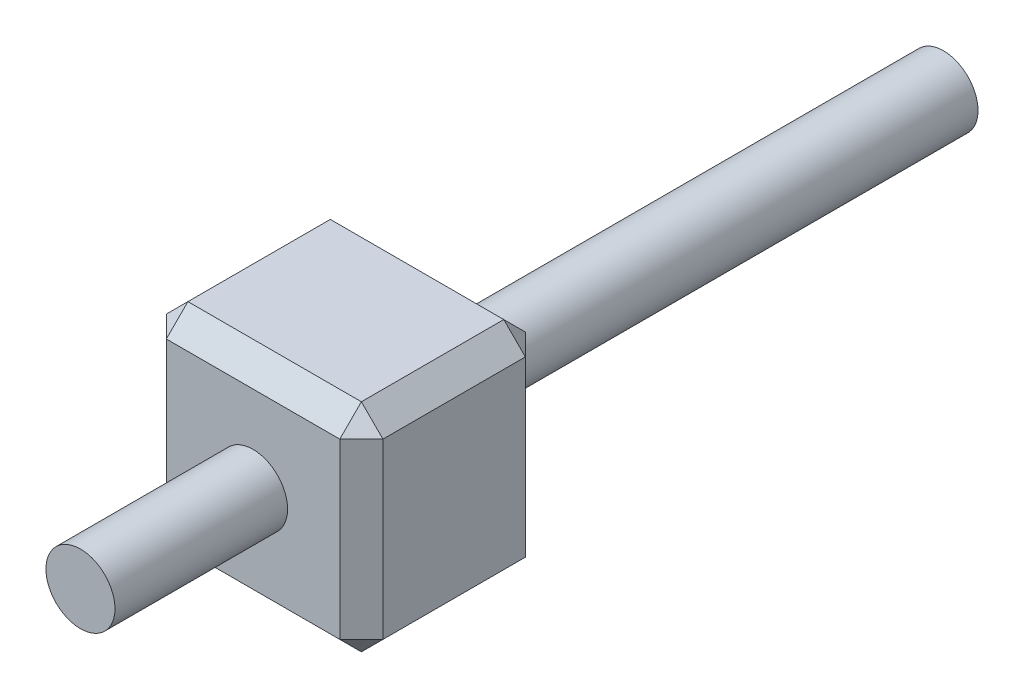
ISO-10303-21;
HEADER;
FILE_DESCRIPTION(('STEP AP214'),'2;1');
FILE_NAME('part.step','',(''),(''),'','','');
FILE_SCHEMA(('AUTOMOTIVE_DESIGN { 1 0 10303 214 1 1 1 1 }'));
ENDSEC;
DATA;
#1=APPLICATION_CONTEXT('core data for automotive mechanical design processes');
#2=APPLICATION_PROTOCOL_DEFINITION('international standard','automotive_design',2000,#1);
#3=PRODUCT_CONTEXT('',#1,'mechanical');
#4=PRODUCT('Part','Part','',(#3));
#5=PRODUCT_RELATED_PRODUCT_CATEGORY('part','',(#4));
#6=PRODUCT_DEFINITION_FORMATION('','',#4);
#7=PRODUCT_DEFINITION_CONTEXT('part definition',#1,'design');
#8=PRODUCT_DEFINITION('design','',#6,#7);
#9=PRODUCT_DEFINITION_SHAPE('','',#8);
#10=(LENGTH_UNIT() NAMED_UNIT(*) SI_UNIT(.MILLI.,.METRE.));
#11=(NAMED_UNIT(*) PLANE_ANGLE_UNIT() SI_UNIT($,.RADIAN.));
#12=(NAMED_UNIT(*) SI_UNIT($,.STERADIAN.) SOLID_ANGLE_UNIT());
#13=UNCERTAINTY_MEASURE_WITH_UNIT(LENGTH_MEASURE(1.E-05),#10,'distance_accuracy_value','');
#14=(GEOMETRIC_REPRESENTATION_CONTEXT(3) GLOBAL_UNCERTAINTY_ASSIGNED_CONTEXT((#13)) GLOBAL_UNIT_ASSIGNED_CONTEXT((#10,
#11,#12)) REPRESENTATION_CONTEXT('',''));
#15=CARTESIAN_POINT('',(0.,0.,0.));
#16=DIRECTION('',(0.,0.,1.));
#17=DIRECTION('',(1.,0.,0.));
#18=AXIS2_PLACEMENT_3D('',#15,#16,#17);
#19=CARTESIAN_POINT('',(-30.5004152134197,21.8097143331672,2.15));
#20=DIRECTION('',(0.,0.,1.));
#21=DIRECTION('',(1.,0.,0.));
#22=AXIS2_PLACEMENT_3D('',#19,#20,#21);
#23=PLANE('',#22);
#24=DIRECTION('',(-1.,0.,0.));
#25=VECTOR('',#24,1.);
#26=CARTESIAN_POINT('',(-30.5004152134197,24.0697143331672,2.15));
#27=LINE('',#26,#25);
#28=CARTESIAN_POINT('',(-28.2404152134197,24.0697143331672,2.15));
#29=VERTEX_POINT('',#28);
#30=CARTESIAN_POINT('',(-30.2504152134197,24.0697143331672,2.15));
#31=VERTEX_POINT('',#30);
#32=EDGE_CURVE('E122',#29,#31,#27,.T.);
#33=ORIENTED_EDGE('',*,*,#32,.T.);
#34=DIRECTION('',(0.,-1.,0.));
#35=VECTOR('',#34,1.);
#36=CARTESIAN_POINT('',(-30.2504152134197,21.8097143331672,2.15));
#37=LINE('',#36,#35);
#38=CARTESIAN_POINT('',(-30.2504152134197,22.0597143331672,2.15));
#39=VERTEX_POINT('',#38);
#40=EDGE_CURVE('E161',#31,#39,#37,.T.);
#41=ORIENTED_EDGE('',*,*,#40,.T.);
#42=DIRECTION('',(1.,0.,0.));
#43=VECTOR('',#42,1.);
#44=CARTESIAN_POINT('',(-27.9904152134197,22.0597143331672,2.15));
#45=LINE('',#44,#43);
#46=CARTESIAN_POINT('',(-28.2404152134197,22.0597143331672,2.15));
#47=VERTEX_POINT('',#46);
#48=EDGE_CURVE('E125',#39,#47,#45,.T.);
#49=ORIENTED_EDGE('',*,*,#48,.T.);
#50=DIRECTION('',(0.,1.,0.));
#51=VECTOR('',#50,1.);
#52=CARTESIAN_POINT('',(-28.2404152134197,24.3197143331672,2.15));
#53=LINE('',#52,#51);
#54=EDGE_CURVE('E117',#47,#29,#53,.T.);
#55=ORIENTED_EDGE('',*,*,#54,.T.);
#56=EDGE_LOOP('',(#33,#41,#49,#55));
#57=FACE_BOUND('',#56,.T.);
#58=CARTESIAN_POINT('',(-29.2454152134197,23.0647143331672,2.15));
#59=DIRECTION('',(0.,0.,1.));
#60=DIRECTION('',(1.,0.,0.));
#61=AXIS2_PLACEMENT_3D('',#58,#59,#60);
#62=CIRCLE('',#61,0.400000000000002);
#63=CARTESIAN_POINT('',(-28.8454152134197,23.0647143331672,2.15));
#64=VERTEX_POINT('',#63);
#65=EDGE_CURVE('E156',#64,#64,#62,.F.);
#66=ORIENTED_EDGE('',*,*,#65,.T.);
#67=EDGE_LOOP('',(#66));
#68=FACE_BOUND('',#67,.T.);
#69=ADVANCED_FACE('F32',(#57,#68),#23,.T.);
#70=CARTESIAN_POINT('',(-30.5004152134197,21.8097143331672,0.));
#71=DIRECTION('',(0.,0.,1.));
#72=DIRECTION('',(1.,0.,0.));
#73=AXIS2_PLACEMENT_3D('',#70,#71,#72);
#74=PLANE('',#73);
#75=DIRECTION('',(-1.,0.,0.));
#76=VECTOR('',#75,1.);
#77=CARTESIAN_POINT('',(-30.5004152134197,22.0597143331672,0.));
#78=LINE('',#77,#76);
#79=CARTESIAN_POINT('',(-28.2404152134197,22.0597143331672,0.));
#80=VERTEX_POINT('',#79);
#81=CARTESIAN_POINT('',(-30.2504152134197,22.0597143331672,0.));
#82=VERTEX_POINT('',#81);
#83=EDGE_CURVE('E176',#80,#82,#78,.T.);
#84=ORIENTED_EDGE('',*,*,#83,.T.);
#85=DIRECTION('',(0.,1.,0.));
#86=VECTOR('',#85,1.);
#87=CARTESIAN_POINT('',(-30.2504152134197,21.8097143331672,0.));
#88=LINE('',#87,#86);
#89=CARTESIAN_POINT('',(-30.2504152134197,24.0697143331672,0.));
#90=VERTEX_POINT('',#89);
#91=EDGE_CURVE('E178',#82,#90,#88,.T.);
#92=ORIENTED_EDGE('',*,*,#91,.T.);
#93=DIRECTION('',(1.,0.,0.));
#94=VECTOR('',#93,1.);
#95=CARTESIAN_POINT('',(-30.5004152134197,24.0697143331672,0.));
#96=LINE('',#95,#94);
#97=CARTESIAN_POINT('',(-28.2404152134197,24.0697143331672,0.));
#98=VERTEX_POINT('',#97);
#99=EDGE_CURVE('E172',#90,#98,#96,.T.);
#100=ORIENTED_EDGE('',*,*,#99,.T.);
#101=DIRECTION('',(0.,-1.,0.));
#102=VECTOR('',#101,1.);
#103=CARTESIAN_POINT('',(-28.2404152134197,21.8097143331672,0.));
#104=LINE('',#103,#102);
#105=EDGE_CURVE('E174',#98,#80,#104,.T.);
#106=ORIENTED_EDGE('',*,*,#105,.T.);
#107=EDGE_LOOP('',(#84,#92,#100,#106));
#108=FACE_BOUND('',#107,.T.);
#109=CARTESIAN_POINT('',(-29.2454152134197,23.0647143331672,0.));
#110=DIRECTION('',(0.,0.,1.));
#111=DIRECTION('',(1.,0.,0.));
#112=AXIS2_PLACEMENT_3D('',#109,#110,#111);
#113=CIRCLE('',#112,0.400000000000002);
#114=CARTESIAN_POINT('',(-28.8454152134197,23.0647143331672,0.));
#115=VERTEX_POINT('',#114);
#116=EDGE_CURVE('E153',#115,#115,#113,.F.);
#117=ORIENTED_EDGE('',*,*,#116,.F.);
#118=EDGE_LOOP('',(#117));
#119=FACE_BOUND('',#118,.T.);
#120=ADVANCED_FACE('F294',(#108,#119),#74,.F.);
#121=CARTESIAN_POINT('',(-30.5004152134197,24.3197143331672,2.15));
#122=DIRECTION('',(1.,0.,0.));
#123=DIRECTION('',(0.,0.,-1.));
#124=AXIS2_PLACEMENT_3D('',#121,#122,#123);
#125=PLANE('',#124);
#126=DIRECTION('',(0.,-1.,0.));
#127=VECTOR('',#126,1.);
#128=CARTESIAN_POINT('',(-30.5004152134197,24.3197143331672,0.25));
#129=LINE('',#128,#127);
#130=CARTESIAN_POINT('',(-30.5004152134197,24.0697143331672,0.25));
#131=VERTEX_POINT('',#130);
#132=CARTESIAN_POINT('',(-30.5004152134197,22.0597143331672,0.25));
#133=VERTEX_POINT('',#132);
#134=EDGE_CURVE('E165',#131,#133,#129,.T.);
#135=ORIENTED_EDGE('',*,*,#134,.T.);
#136=DIRECTION('',(0.,0.,1.));
#137=VECTOR('',#136,1.);
#138=CARTESIAN_POINT('',(-30.5004152134197,22.0597143331672,2.15));
#139=LINE('',#138,#137);
#140=CARTESIAN_POINT('',(-30.5004152134197,22.0597143331672,1.9));
#141=VERTEX_POINT('',#140);
#142=EDGE_CURVE('E170',#133,#141,#139,.T.);
#143=ORIENTED_EDGE('',*,*,#142,.T.);
#144=DIRECTION('',(0.,1.,0.));
#145=VECTOR('',#144,1.);
#146=CARTESIAN_POINT('',(-30.5004152134197,24.3197143331672,1.9));
#147=LINE('',#146,#145);
#148=CARTESIAN_POINT('',(-30.5004152134197,24.0697143331672,1.9));
#149=VERTEX_POINT('',#148);
#150=EDGE_CURVE('E167',#141,#149,#147,.T.);
#151=ORIENTED_EDGE('',*,*,#150,.T.);
#152=DIRECTION('',(0.,0.,-1.));
#153=VECTOR('',#152,1.);
#154=CARTESIAN_POINT('',(-30.5004152134197,24.0697143331672,2.15));
#155=LINE('',#154,#153);
#156=EDGE_CURVE('E163',#149,#131,#155,.T.);
#157=ORIENTED_EDGE('',*,*,#156,.T.);
#158=EDGE_LOOP('',(#135,#143,#151,#157));
#159=FACE_BOUND('',#158,.T.);
#160=ADVANCED_FACE('F34',(#159),#125,.F.);
#161=CARTESIAN_POINT('',(-30.5004152134197,21.8097143331672,2.15));
#162=DIRECTION('',(0.,1.,0.));
#163=DIRECTION('',(0.,0.,1.));
#164=AXIS2_PLACEMENT_3D('',#161,#162,#163);
#165=PLANE('',#164);
#166=DIRECTION('',(-1.,0.,0.));
#167=VECTOR('',#166,1.);
#168=CARTESIAN_POINT('',(-30.5004152134197,21.8097143331672,1.9));
#169=LINE('',#168,#167);
#170=CARTESIAN_POINT('',(-28.2404152134197,21.8097143331672,1.9));
#171=VERTEX_POINT('',#170);
#172=CARTESIAN_POINT('',(-30.2504152134197,21.8097143331672,1.9));
#173=VERTEX_POINT('',#172);
#174=EDGE_CURVE('E185',#171,#173,#169,.T.);
#175=ORIENTED_EDGE('',*,*,#174,.T.);
#176=DIRECTION('',(0.,0.,-1.));
#177=VECTOR('',#176,1.);
#178=CARTESIAN_POINT('',(-30.2504152134197,21.8097143331672,2.15));
#179=LINE('',#178,#177);
#180=CARTESIAN_POINT('',(-30.2504152134197,21.8097143331672,0.25));
#181=VERTEX_POINT('',#180);
#182=EDGE_CURVE('E187',#173,#181,#179,.T.);
#183=ORIENTED_EDGE('',*,*,#182,.T.);
#184=DIRECTION('',(1.,0.,0.));
#185=VECTOR('',#184,1.);
#186=CARTESIAN_POINT('',(-30.5004152134197,21.8097143331672,0.25));
#187=LINE('',#186,#185);
#188=CARTESIAN_POINT('',(-28.2404152134197,21.8097143331672,0.25));
#189=VERTEX_POINT('',#188);
#190=EDGE_CURVE('E183',#181,#189,#187,.T.);
#191=ORIENTED_EDGE('',*,*,#190,.T.);
#192=DIRECTION('',(0.,0.,1.));
#193=VECTOR('',#192,1.);
#194=CARTESIAN_POINT('',(-28.2404152134197,21.8097143331672,2.15));
#195=LINE('',#194,#193);
#196=EDGE_CURVE('E181',#189,#171,#195,.T.);
#197=ORIENTED_EDGE('',*,*,#196,.T.);
#198=EDGE_LOOP('',(#175,#183,#191,#197));
#199=FACE_BOUND('',#198,.T.);
#200=ADVANCED_FACE('F307',(#199),#165,.F.);
#201=CARTESIAN_POINT('',(-27.9904152134197,24.3197143331672,2.15));
#202=DIRECTION('',(-1.,0.,0.));
#203=DIRECTION('',(0.,-1.,0.));
#204=AXIS2_PLACEMENT_3D('',#201,#202,#203);
#205=PLANE('',#204);
#206=DIRECTION('',(0.,-1.,0.));
#207=VECTOR('',#206,1.);
#208=CARTESIAN_POINT('',(-27.9904152134197,21.8097143331672,1.9));
#209=LINE('',#208,#207);
#210=CARTESIAN_POINT('',(-27.9904152134197,24.0697143331672,1.9));
#211=VERTEX_POINT('',#210);
#212=CARTESIAN_POINT('',(-27.9904152134197,22.0597143331672,1.9));
#213=VERTEX_POINT('',#212);
#214=EDGE_CURVE('E135',#211,#213,#209,.T.);
#215=ORIENTED_EDGE('',*,*,#214,.T.);
#216=DIRECTION('',(0.,0.,-1.));
#217=VECTOR('',#216,1.);
#218=CARTESIAN_POINT('',(-27.9904152134197,22.0597143331672,2.15));
#219=LINE('',#218,#217);
#220=CARTESIAN_POINT('',(-27.9904152134197,22.0597143331672,0.25));
#221=VERTEX_POINT('',#220);
#222=EDGE_CURVE('E195',#213,#221,#219,.T.);
#223=ORIENTED_EDGE('',*,*,#222,.T.);
#224=DIRECTION('',(0.,1.,0.));
#225=VECTOR('',#224,1.);
#226=CARTESIAN_POINT('',(-27.9904152134197,24.3197143331672,0.25));
#227=LINE('',#226,#225);
#228=CARTESIAN_POINT('',(-27.9904152134197,24.0697143331672,0.25));
#229=VERTEX_POINT('',#228);
#230=EDGE_CURVE('E192',#221,#229,#227,.T.);
#231=ORIENTED_EDGE('',*,*,#230,.T.);
#232=DIRECTION('',(0.,0.,1.));
#233=VECTOR('',#232,1.);
#234=CARTESIAN_POINT('',(-27.9904152134197,24.0697143331672,2.15));
#235=LINE('',#234,#233);
#236=EDGE_CURVE('E190',#229,#211,#235,.T.);
#237=ORIENTED_EDGE('',*,*,#236,.T.);
#238=EDGE_LOOP('',(#215,#223,#231,#237));
#239=FACE_BOUND('',#238,.T.);
#240=ADVANCED_FACE('F305',(#239),#205,.F.);
#241=CARTESIAN_POINT('',(-30.5004152134197,24.3197143331672,2.15));
#242=DIRECTION('',(0.,-1.,0.));
#243=DIRECTION('',(0.,0.,-1.));
#244=AXIS2_PLACEMENT_3D('',#241,#242,#243);
#245=PLANE('',#244);
#246=DIRECTION('',(1.,0.,0.));
#247=VECTOR('',#246,1.);
#248=CARTESIAN_POINT('',(-27.9904152134197,24.3197143331672,1.9));
#249=LINE('',#248,#247);
#250=CARTESIAN_POINT('',(-30.2504152134197,24.3197143331672,1.9));
#251=VERTEX_POINT('',#250);
#252=CARTESIAN_POINT('',(-28.2404152134197,24.3197143331672,1.9));
#253=VERTEX_POINT('',#252);
#254=EDGE_CURVE('E40',#251,#253,#249,.T.);
#255=ORIENTED_EDGE('',*,*,#254,.T.);
#256=DIRECTION('',(0.,0.,-1.));
#257=VECTOR('',#256,1.);
#258=CARTESIAN_POINT('',(-28.2404152134197,24.3197143331672,2.15));
#259=LINE('',#258,#257);
#260=CARTESIAN_POINT('',(-28.2404152134197,24.3197143331672,0.25));
#261=VERTEX_POINT('',#260);
#262=EDGE_CURVE('E11',#253,#261,#259,.T.);
#263=ORIENTED_EDGE('',*,*,#262,.T.);
#264=DIRECTION('',(-1.,0.,0.));
#265=VECTOR('',#264,1.);
#266=CARTESIAN_POINT('',(-30.5004152134197,24.3197143331672,0.25));
#267=LINE('',#266,#265);
#268=CARTESIAN_POINT('',(-30.2504152134197,24.3197143331672,0.25));
#269=VERTEX_POINT('',#268);
#270=EDGE_CURVE('E198',#261,#269,#267,.T.);
#271=ORIENTED_EDGE('',*,*,#270,.T.);
#272=DIRECTION('',(0.,0.,1.));
#273=VECTOR('',#272,1.);
#274=CARTESIAN_POINT('',(-30.2504152134197,24.3197143331672,2.15));
#275=LINE('',#274,#273);
#276=EDGE_CURVE('E50',#269,#251,#275,.T.);
#277=ORIENTED_EDGE('',*,*,#276,.T.);
#278=EDGE_LOOP('',(#255,#263,#271,#277));
#279=FACE_BOUND('',#278,.T.);
#280=ADVANCED_FACE('F201',(#279),#245,.F.);
#281=CARTESIAN_POINT('',(-29.2454152134197,23.0647143331672,-5.85));
#282=DIRECTION('',(0.,0.,1.));
#283=DIRECTION('',(1.,0.,0.));
#284=AXIS2_PLACEMENT_3D('',#281,#282,#283);
#285=PLANE('',#284);
#286=CARTESIAN_POINT('',(-29.2454152134197,23.0647143331672,-5.85));
#287=DIRECTION('',(0.,0.,1.));
#288=DIRECTION('',(1.,0.,0.));
#289=AXIS2_PLACEMENT_3D('',#286,#287,#288);
#290=CIRCLE('',#289,0.400000000000002);
#291=CARTESIAN_POINT('',(-28.8454152134197,23.0647143331672,-5.85));
#292=VERTEX_POINT('',#291);
#293=EDGE_CURVE('E267',#292,#292,#290,.T.);
#294=ORIENTED_EDGE('',*,*,#293,.F.);
#295=EDGE_LOOP('',(#294));
#296=FACE_BOUND('',#295,.T.);
#297=ADVANCED_FACE('F304',(#296),#285,.F.);
#298=CARTESIAN_POINT('',(-29.2454152134197,23.0647143331672,4.15));
#299=DIRECTION('',(0.,0.,-1.));
#300=DIRECTION('',(-1.,0.,0.));
#301=AXIS2_PLACEMENT_3D('',#298,#299,#300);
#302=CYLINDRICAL_SURFACE('',#301,0.400000000000002);
#303=ORIENTED_EDGE('',*,*,#293,.T.);
#304=EDGE_LOOP('',(#303));
#305=FACE_BOUND('',#304,.T.);
#306=ORIENTED_EDGE('',*,*,#116,.T.);
#307=EDGE_LOOP('',(#306));
#308=FACE_BOUND('',#307,.T.);
#309=ADVANCED_FACE('F279',(#305,#308),#302,.T.);
#310=ORIENTED_EDGE('',*,*,#65,.F.);
#311=EDGE_LOOP('',(#310));
#312=FACE_BOUND('',#311,.T.);
#313=CARTESIAN_POINT('',(-29.2454152134197,23.0647143331672,4.15));
#314=DIRECTION('',(0.,0.,1.));
#315=DIRECTION('',(1.,0.,0.));
#316=AXIS2_PLACEMENT_3D('',#313,#314,#315);
#317=CIRCLE('',#316,0.400000000000002);
#318=CARTESIAN_POINT('',(-28.8454152134197,23.0647143331672,4.15));
#319=VERTEX_POINT('',#318);
#320=EDGE_CURVE('E270',#319,#319,#317,.T.);
#321=ORIENTED_EDGE('',*,*,#320,.F.);
#322=EDGE_LOOP('',(#321));
#323=FACE_BOUND('',#322,.T.);
#324=ADVANCED_FACE('F275',(#312,#323),#302,.T.);
#325=CARTESIAN_POINT('',(-29.2454152134197,23.0647143331672,4.15));
#326=DIRECTION('',(0.,0.,1.));
#327=DIRECTION('',(1.,0.,0.));
#328=AXIS2_PLACEMENT_3D('',#325,#326,#327);
#329=PLANE('',#328);
#330=ORIENTED_EDGE('',*,*,#320,.T.);
#331=EDGE_LOOP('',(#330));
#332=FACE_BOUND('',#331,.T.);
#333=ADVANCED_FACE('F278',(#332),#329,.T.);
#334=CARTESIAN_POINT('',(-27.9904152134197,24.3197143331672,0.25));
#335=DIRECTION('',(-0.707106781186547,0.,0.707106781186547));
#336=DIRECTION('',(0.707106781186548,0.,0.707106781186548));
#337=AXIS2_PLACEMENT_3D('',#334,#335,#336);
#338=PLANE('',#337);
#339=DIRECTION('',(0.707106781186548,0.,0.707106781186548));
#340=VECTOR('',#339,1.);
#341=CARTESIAN_POINT('',(-27.9904152134197,24.0697143331672,0.25));
#342=LINE('',#341,#340);
#343=EDGE_CURVE('E264',#229,#98,#342,.F.);
#344=ORIENTED_EDGE('',*,*,#343,.F.);
#345=ORIENTED_EDGE('',*,*,#230,.F.);
#346=DIRECTION('',(-0.707106781186547,0.,-0.707106781186547));
#347=VECTOR('',#346,1.);
#348=CARTESIAN_POINT('',(-28.1154152134197,22.0597143331672,0.125));
#349=LINE('',#348,#347);
#350=EDGE_CURVE('E261',#80,#221,#349,.F.);
#351=ORIENTED_EDGE('',*,*,#350,.F.);
#352=ORIENTED_EDGE('',*,*,#105,.F.);
#353=EDGE_LOOP('',(#344,#345,#351,#352));
#354=FACE_BOUND('',#353,.T.);
#355=ADVANCED_FACE('F284',(#354),#338,.F.);
#356=CARTESIAN_POINT('',(-27.9904152134197,24.0697143331672,0.25));
#357=DIRECTION('',(0.577350269189626,0.577350269189626,-0.577350269189626));
#358=DIRECTION('',(-0.707106781186547,0.,-0.707106781186547));
#359=AXIS2_PLACEMENT_3D('',#356,#357,#358);
#360=PLANE('',#359);
#361=DIRECTION('',(-0.707106781186547,0.707106781186547,0.));
#362=VECTOR('',#361,1.);
#363=CARTESIAN_POINT('',(-27.9904152134197,24.0697143331672,0.25));
#364=LINE('',#363,#362);
#365=EDGE_CURVE('E256',#229,#261,#364,.T.);
#366=ORIENTED_EDGE('',*,*,#365,.F.);
#367=ORIENTED_EDGE('',*,*,#343,.T.);
#368=DIRECTION('',(0.,-0.707106781186547,-0.707106781186547));
#369=VECTOR('',#368,1.);
#370=CARTESIAN_POINT('',(-28.2404152134197,24.1947143331672,0.125));
#371=LINE('',#370,#369);
#372=EDGE_CURVE('E259',#261,#98,#371,.T.);
#373=ORIENTED_EDGE('',*,*,#372,.F.);
#374=EDGE_LOOP('',(#366,#367,#373));
#375=FACE_BOUND('',#374,.T.);
#376=ADVANCED_FACE('F289',(#375),#360,.T.);
#377=CARTESIAN_POINT('',(-28.2404152134197,21.8097143331672,0.25));
#378=DIRECTION('',(0.577350269189626,-0.577350269189626,-0.577350269189626));
#379=DIRECTION('',(-0.707106781186547,0.,-0.707106781186547));
#380=AXIS2_PLACEMENT_3D('',#377,#378,#379);
#381=PLANE('',#380);
#382=DIRECTION('',(0.,-0.707106781186547,0.707106781186547));
#383=VECTOR('',#382,1.);
#384=CARTESIAN_POINT('',(-28.2404152134197,21.8097143331672,0.25));
#385=LINE('',#384,#383);
#386=EDGE_CURVE('E251',#80,#189,#385,.T.);
#387=ORIENTED_EDGE('',*,*,#386,.F.);
#388=ORIENTED_EDGE('',*,*,#350,.T.);
#389=DIRECTION('',(0.707106781186547,0.707106781186547,0.));
#390=VECTOR('',#389,1.);
#391=CARTESIAN_POINT('',(-28.2404152134197,21.8097143331672,0.25));
#392=LINE('',#391,#390);
#393=EDGE_CURVE('E254',#189,#221,#392,.T.);
#394=ORIENTED_EDGE('',*,*,#393,.F.);
#395=EDGE_LOOP('',(#387,#388,#394));
#396=FACE_BOUND('',#395,.T.);
#397=ADVANCED_FACE('F352',(#396),#381,.T.);
#398=CARTESIAN_POINT('',(-30.5004152134197,24.3197143331672,0.25));
#399=DIRECTION('',(0.,-0.707106781186547,0.707106781186547));
#400=DIRECTION('',(0.,-0.707106781186548,-0.707106781186548));
#401=AXIS2_PLACEMENT_3D('',#398,#399,#400);
#402=PLANE('',#401);
#403=ORIENTED_EDGE('',*,*,#372,.T.);
#404=ORIENTED_EDGE('',*,*,#99,.F.);
#405=DIRECTION('',(0.,0.707106781186547,0.707106781186547));
#406=VECTOR('',#405,1.);
#407=CARTESIAN_POINT('',(-30.2504152134197,24.0697143331672,0.));
#408=LINE('',#407,#406);
#409=EDGE_CURVE('E206',#269,#90,#408,.F.);
#410=ORIENTED_EDGE('',*,*,#409,.F.);
#411=ORIENTED_EDGE('',*,*,#270,.F.);
#412=EDGE_LOOP('',(#403,#404,#410,#411));
#413=FACE_BOUND('',#412,.T.);
#414=ADVANCED_FACE('F208',(#413),#402,.F.);
#415=CARTESIAN_POINT('',(-28.2404152134197,24.3197143331672,2.15));
#416=DIRECTION('',(-0.707106781186547,-0.707106781186547,0.));
#417=DIRECTION('',(0.707106781186548,-0.707106781186548,0.));
#418=AXIS2_PLACEMENT_3D('',#415,#416,#417);
#419=PLANE('',#418);
#420=ORIENTED_EDGE('',*,*,#365,.T.);
#421=ORIENTED_EDGE('',*,*,#262,.F.);
#422=DIRECTION('',(0.707106781186547,-0.707106781186547,0.));
#423=VECTOR('',#422,1.);
#424=CARTESIAN_POINT('',(-28.1154152134197,24.1947143331672,1.9));
#425=LINE('',#424,#423);
#426=EDGE_CURVE('E139',#211,#253,#425,.F.);
#427=ORIENTED_EDGE('',*,*,#426,.F.);
#428=ORIENTED_EDGE('',*,*,#236,.F.);
#429=EDGE_LOOP('',(#420,#421,#427,#428));
#430=FACE_BOUND('',#429,.T.);
#431=ADVANCED_FACE('F381',(#430),#419,.F.);
#432=CARTESIAN_POINT('',(-28.2404152134197,21.8097143331672,2.15));
#433=DIRECTION('',(0.707106781186547,0.,0.707106781186547));
#434=DIRECTION('',(0.707106781186548,0.,-0.707106781186548));
#435=AXIS2_PLACEMENT_3D('',#432,#433,#434);
#436=PLANE('',#435);
#437=DIRECTION('',(-0.707106781186547,0.,0.707106781186547));
#438=VECTOR('',#437,1.);
#439=CARTESIAN_POINT('',(-28.2404152134197,22.0597143331672,2.15));
#440=LINE('',#439,#438);
#441=EDGE_CURVE('E140',#213,#47,#440,.T.);
#442=ORIENTED_EDGE('',*,*,#441,.F.);
#443=ORIENTED_EDGE('',*,*,#214,.F.);
#444=DIRECTION('',(0.707106781186548,0.,-0.707106781186548));
#445=VECTOR('',#444,1.);
#446=CARTESIAN_POINT('',(-28.2404152134197,24.0697143331672,2.15));
#447=LINE('',#446,#445);
#448=EDGE_CURVE('E132',#29,#211,#447,.T.);
#449=ORIENTED_EDGE('',*,*,#448,.F.);
#450=ORIENTED_EDGE('',*,*,#54,.F.);
#451=EDGE_LOOP('',(#442,#443,#449,#450));
#452=FACE_BOUND('',#451,.T.);
#453=ADVANCED_FACE('F134',(#452),#436,.T.);
#454=CARTESIAN_POINT('',(-27.9904152134197,22.0597143331672,2.15));
#455=DIRECTION('',(-0.707106781186547,0.707106781186547,0.));
#456=DIRECTION('',(-0.707106781186548,-0.707106781186548,0.));
#457=AXIS2_PLACEMENT_3D('',#454,#455,#456);
#458=PLANE('',#457);
#459=ORIENTED_EDGE('',*,*,#393,.T.);
#460=ORIENTED_EDGE('',*,*,#222,.F.);
#461=DIRECTION('',(-0.707106781186547,-0.707106781186547,0.));
#462=VECTOR('',#461,1.);
#463=CARTESIAN_POINT('',(-28.1154152134197,21.9347143331672,1.9));
#464=LINE('',#463,#462);
#465=EDGE_CURVE('E245',#171,#213,#464,.F.);
#466=ORIENTED_EDGE('',*,*,#465,.F.);
#467=ORIENTED_EDGE('',*,*,#196,.F.);
#468=EDGE_LOOP('',(#459,#460,#466,#467));
#469=FACE_BOUND('',#468,.T.);
#470=ADVANCED_FACE('F357',(#469),#458,.F.);
#471=CARTESIAN_POINT('',(-30.5004152134197,21.8097143331672,0.25));
#472=DIRECTION('',(0.,0.707106781186547,0.707106781186547));
#473=DIRECTION('',(0.,-0.707106781186548,0.707106781186548));
#474=AXIS2_PLACEMENT_3D('',#471,#472,#473);
#475=PLANE('',#474);
#476=ORIENTED_EDGE('',*,*,#386,.T.);
#477=ORIENTED_EDGE('',*,*,#190,.F.);
#478=DIRECTION('',(0.,0.707106781186547,-0.707106781186547));
#479=VECTOR('',#478,1.);
#480=CARTESIAN_POINT('',(-30.2504152134197,21.9347143331672,0.125));
#481=LINE('',#480,#479);
#482=EDGE_CURVE('E242',#82,#181,#481,.F.);
#483=ORIENTED_EDGE('',*,*,#482,.F.);
#484=ORIENTED_EDGE('',*,*,#83,.F.);
#485=EDGE_LOOP('',(#476,#477,#483,#484));
#486=FACE_BOUND('',#485,.T.);
#487=ADVANCED_FACE('F348',(#486),#475,.F.);
#488=CARTESIAN_POINT('',(-30.5004152134197,24.3197143331672,0.25));
#489=DIRECTION('',(0.707106781186547,0.,0.707106781186547));
#490=DIRECTION('',(0.707106781186548,0.,-0.707106781186548));
#491=AXIS2_PLACEMENT_3D('',#488,#489,#490);
#492=PLANE('',#491);
#493=DIRECTION('',(0.707106781186547,0.,-0.707106781186547));
#494=VECTOR('',#493,1.);
#495=CARTESIAN_POINT('',(-30.2504152134197,24.0697143331672,0.));
#496=LINE('',#495,#494);
#497=EDGE_CURVE('E212',#90,#131,#496,.F.);
#498=ORIENTED_EDGE('',*,*,#497,.F.);
#499=ORIENTED_EDGE('',*,*,#91,.F.);
#500=DIRECTION('',(-0.707106781186547,0.,0.707106781186547));
#501=VECTOR('',#500,1.);
#502=CARTESIAN_POINT('',(-30.5004152134197,22.0597143331672,0.25));
#503=LINE('',#502,#501);
#504=EDGE_CURVE('E218',#133,#82,#503,.F.);
#505=ORIENTED_EDGE('',*,*,#504,.F.);
#506=ORIENTED_EDGE('',*,*,#134,.F.);
#507=EDGE_LOOP('',(#498,#499,#505,#506));
#508=FACE_BOUND('',#507,.T.);
#509=ADVANCED_FACE('F341',(#508),#492,.F.);
#510=CARTESIAN_POINT('',(-30.2504152134197,24.0697143331672,0.));
#511=DIRECTION('',(-0.577350269189626,0.577350269189626,-0.577350269189626));
#512=DIRECTION('',(-0.707106781186547,0.,0.707106781186547));
#513=AXIS2_PLACEMENT_3D('',#510,#511,#512);
#514=PLANE('',#513);
#515=ORIENTED_EDGE('',*,*,#409,.T.);
#516=ORIENTED_EDGE('',*,*,#497,.T.);
#517=DIRECTION('',(-0.707106781186547,-0.707106781186547,0.));
#518=VECTOR('',#517,1.);
#519=CARTESIAN_POINT('',(-30.3754152134197,24.1947143331672,0.25));
#520=LINE('',#519,#518);
#521=EDGE_CURVE('E146',#269,#131,#520,.T.);
#522=ORIENTED_EDGE('',*,*,#521,.F.);
#523=EDGE_LOOP('',(#515,#516,#522));
#524=FACE_BOUND('',#523,.T.);
#525=ADVANCED_FACE('F215',(#524),#514,.T.);
#526=CARTESIAN_POINT('',(-28.2404152134197,24.0697143331672,2.15));
#527=DIRECTION('',(0.577350269189626,0.577350269189626,0.577350269189626));
#528=DIRECTION('',(0.707106781186547,0.,-0.707106781186547));
#529=AXIS2_PLACEMENT_3D('',#526,#527,#528);
#530=PLANE('',#529);
#531=ORIENTED_EDGE('',*,*,#448,.T.);
#532=ORIENTED_EDGE('',*,*,#426,.T.);
#533=DIRECTION('',(0.,-0.707106781186547,0.707106781186547));
#534=VECTOR('',#533,1.);
#535=CARTESIAN_POINT('',(-28.2404152134197,24.0697143331672,2.15));
#536=LINE('',#535,#534);
#537=EDGE_CURVE('E143',#29,#253,#536,.F.);
#538=ORIENTED_EDGE('',*,*,#537,.F.);
#539=EDGE_LOOP('',(#531,#532,#538));
#540=FACE_BOUND('',#539,.T.);
#541=ADVANCED_FACE('F144',(#540),#530,.T.);
#542=CARTESIAN_POINT('',(-28.2404152134197,22.0597143331672,2.15));
#543=DIRECTION('',(0.577350269189626,-0.577350269189626,0.577350269189626));
#544=DIRECTION('',(0.707106781186547,0.,-0.707106781186547));
#545=AXIS2_PLACEMENT_3D('',#542,#543,#544);
#546=PLANE('',#545);
#547=ORIENTED_EDGE('',*,*,#465,.T.);
#548=ORIENTED_EDGE('',*,*,#441,.T.);
#549=DIRECTION('',(0.,-0.707106781186547,-0.707106781186547));
#550=VECTOR('',#549,1.);
#551=CARTESIAN_POINT('',(-28.2404152134197,22.0597143331672,2.15));
#552=LINE('',#551,#550);
#553=EDGE_CURVE('E147',#171,#47,#552,.F.);
#554=ORIENTED_EDGE('',*,*,#553,.F.);
#555=EDGE_LOOP('',(#547,#548,#554));
#556=FACE_BOUND('',#555,.T.);
#557=ADVANCED_FACE('F360',(#556),#546,.T.);
#558=CARTESIAN_POINT('',(-30.5004152134197,22.0597143331672,0.25));
#559=DIRECTION('',(-0.577350269189626,-0.577350269189626,-0.577350269189626));
#560=DIRECTION('',(-0.707106781186547,0.,0.707106781186547));
#561=AXIS2_PLACEMENT_3D('',#558,#559,#560);
#562=PLANE('',#561);
#563=ORIENTED_EDGE('',*,*,#504,.T.);
#564=ORIENTED_EDGE('',*,*,#482,.T.);
#565=DIRECTION('',(0.707106781186547,-0.707106781186547,0.));
#566=VECTOR('',#565,1.);
#567=CARTESIAN_POINT('',(-30.5004152134197,22.0597143331672,0.25));
#568=LINE('',#567,#566);
#569=EDGE_CURVE('E225',#133,#181,#568,.T.);
#570=ORIENTED_EDGE('',*,*,#569,.F.);
#571=EDGE_LOOP('',(#563,#564,#570));
#572=FACE_BOUND('',#571,.T.);
#573=ADVANCED_FACE('F344',(#572),#562,.T.);
#574=CARTESIAN_POINT('',(-30.5004152134197,24.0697143331672,2.15));
#575=DIRECTION('',(0.707106781186547,-0.707106781186547,0.));
#576=DIRECTION('',(0.707106781186548,0.707106781186548,0.));
#577=AXIS2_PLACEMENT_3D('',#574,#575,#576);
#578=PLANE('',#577);
#579=ORIENTED_EDGE('',*,*,#521,.T.);
#580=ORIENTED_EDGE('',*,*,#156,.F.);
#581=DIRECTION('',(0.707106781186547,0.707106781186547,0.));
#582=VECTOR('',#581,1.);
#583=CARTESIAN_POINT('',(-30.5004152134197,24.0697143331672,1.9));
#584=LINE('',#583,#582);
#585=EDGE_CURVE('E223',#251,#149,#584,.F.);
#586=ORIENTED_EDGE('',*,*,#585,.F.);
#587=ORIENTED_EDGE('',*,*,#276,.F.);
#588=EDGE_LOOP('',(#579,#580,#586,#587));
#589=FACE_BOUND('',#588,.T.);
#590=ADVANCED_FACE('F221',(#589),#578,.F.);
#591=CARTESIAN_POINT('',(-30.5004152134197,24.0697143331672,2.15));
#592=DIRECTION('',(0.,0.707106781186547,0.707106781186547));
#593=DIRECTION('',(0.,-0.707106781186548,0.707106781186548));
#594=AXIS2_PLACEMENT_3D('',#591,#592,#593);
#595=PLANE('',#594);
#596=ORIENTED_EDGE('',*,*,#537,.T.);
#597=ORIENTED_EDGE('',*,*,#254,.F.);
#598=DIRECTION('',(0.,0.707106781186547,-0.707106781186547));
#599=VECTOR('',#598,1.);
#600=CARTESIAN_POINT('',(-30.2504152134197,24.1947143331672,2.025));
#601=LINE('',#600,#599);
#602=EDGE_CURVE('E151',#31,#251,#601,.T.);
#603=ORIENTED_EDGE('',*,*,#602,.F.);
#604=ORIENTED_EDGE('',*,*,#32,.F.);
#605=EDGE_LOOP('',(#596,#597,#603,#604));
#606=FACE_BOUND('',#605,.T.);
#607=ADVANCED_FACE('F149',(#606),#595,.T.);
#608=CARTESIAN_POINT('',(-30.5004152134197,22.0597143331672,2.15));
#609=DIRECTION('',(0.,-0.707106781186547,0.707106781186547));
#610=DIRECTION('',(0.,-0.707106781186548,-0.707106781186548));
#611=AXIS2_PLACEMENT_3D('',#608,#609,#610);
#612=PLANE('',#611);
#613=ORIENTED_EDGE('',*,*,#553,.T.);
#614=ORIENTED_EDGE('',*,*,#48,.F.);
#615=DIRECTION('',(0.,0.707106781186547,0.707106781186547));
#616=VECTOR('',#615,1.);
#617=CARTESIAN_POINT('',(-30.2504152134197,22.0597143331672,2.15));
#618=LINE('',#617,#616);
#619=EDGE_CURVE('E230',#173,#39,#618,.T.);
#620=ORIENTED_EDGE('',*,*,#619,.F.);
#621=ORIENTED_EDGE('',*,*,#174,.F.);
#622=EDGE_LOOP('',(#613,#614,#620,#621));
#623=FACE_BOUND('',#622,.T.);
#624=ADVANCED_FACE('F328',(#623),#612,.T.);
#625=CARTESIAN_POINT('',(-30.2504152134197,21.8097143331672,2.15));
#626=DIRECTION('',(0.707106781186547,0.707106781186547,0.));
#627=DIRECTION('',(-0.707106781186548,0.707106781186548,0.));
#628=AXIS2_PLACEMENT_3D('',#625,#626,#627);
#629=PLANE('',#628);
#630=ORIENTED_EDGE('',*,*,#569,.T.);
#631=ORIENTED_EDGE('',*,*,#182,.F.);
#632=DIRECTION('',(-0.707106781186547,0.707106781186547,0.));
#633=VECTOR('',#632,1.);
#634=CARTESIAN_POINT('',(-30.3754152134197,21.9347143331672,1.9));
#635=LINE('',#634,#633);
#636=EDGE_CURVE('E233',#141,#173,#635,.F.);
#637=ORIENTED_EDGE('',*,*,#636,.F.);
#638=ORIENTED_EDGE('',*,*,#142,.F.);
#639=EDGE_LOOP('',(#630,#631,#637,#638));
#640=FACE_BOUND('',#639,.T.);
#641=ADVANCED_FACE('F323',(#640),#629,.F.);
#642=CARTESIAN_POINT('',(-30.5004152134197,24.0697143331672,1.9));
#643=DIRECTION('',(-0.577350269189626,0.577350269189626,0.577350269189626));
#644=DIRECTION('',(0.707106781186547,0.,0.707106781186547));
#645=AXIS2_PLACEMENT_3D('',#642,#643,#644);
#646=PLANE('',#645);
#647=ORIENTED_EDGE('',*,*,#602,.T.);
#648=ORIENTED_EDGE('',*,*,#585,.T.);
#649=DIRECTION('',(0.707106781186547,0.,0.707106781186547));
#650=VECTOR('',#649,1.);
#651=CARTESIAN_POINT('',(-30.5004152134197,24.0697143331672,1.9));
#652=LINE('',#651,#650);
#653=EDGE_CURVE('E228',#31,#149,#652,.F.);
#654=ORIENTED_EDGE('',*,*,#653,.F.);
#655=EDGE_LOOP('',(#647,#648,#654));
#656=FACE_BOUND('',#655,.T.);
#657=ADVANCED_FACE('F227',(#656),#646,.T.);
#658=CARTESIAN_POINT('',(-30.2504152134197,22.0597143331672,2.15));
#659=DIRECTION('',(-0.577350269189626,-0.577350269189626,0.577350269189626));
#660=DIRECTION('',(0.707106781186547,0.,0.707106781186547));
#661=AXIS2_PLACEMENT_3D('',#658,#659,#660);
#662=PLANE('',#661);
#663=ORIENTED_EDGE('',*,*,#636,.T.);
#664=ORIENTED_EDGE('',*,*,#619,.T.);
#665=DIRECTION('',(-0.707106781186547,0.,-0.707106781186547));
#666=VECTOR('',#665,1.);
#667=CARTESIAN_POINT('',(-30.2504152134197,22.0597143331672,2.15));
#668=LINE('',#667,#666);
#669=EDGE_CURVE('E332',#141,#39,#668,.F.);
#670=ORIENTED_EDGE('',*,*,#669,.F.);
#671=EDGE_LOOP('',(#663,#664,#670));
#672=FACE_BOUND('',#671,.T.);
#673=ADVANCED_FACE('F331',(#672),#662,.T.);
#674=CARTESIAN_POINT('',(-30.2504152134197,21.8097143331672,2.15));
#675=DIRECTION('',(-0.707106781186547,0.,0.707106781186547));
#676=DIRECTION('',(0.707106781186548,0.,0.707106781186548));
#677=AXIS2_PLACEMENT_3D('',#674,#675,#676);
#678=PLANE('',#677);
#679=ORIENTED_EDGE('',*,*,#653,.T.);
#680=ORIENTED_EDGE('',*,*,#150,.F.);
#681=ORIENTED_EDGE('',*,*,#669,.T.);
#682=ORIENTED_EDGE('',*,*,#40,.F.);
#683=EDGE_LOOP('',(#679,#680,#681,#682));
#684=FACE_BOUND('',#683,.T.);
#685=ADVANCED_FACE('F336',(#684),#678,.T.);
#686=CLOSED_SHELL('',(#69,#120,#160,#200,#240,#280,#297,#309,#324,#333,#355,#376,#397,#414,#431,
#453,#470,#487,#509,#525,#541,#557,#573,#590,#607,#624,#641,#657,#673,#685));
#687=MANIFOLD_SOLID_BREP('B2',#686);
#688=ADVANCED_BREP_SHAPE_REPRESENTATION('',(#18,#687),#14);
#689=SHAPE_DEFINITION_REPRESENTATION(#9,#688);
ENDSEC;
END-ISO-10303-21;
